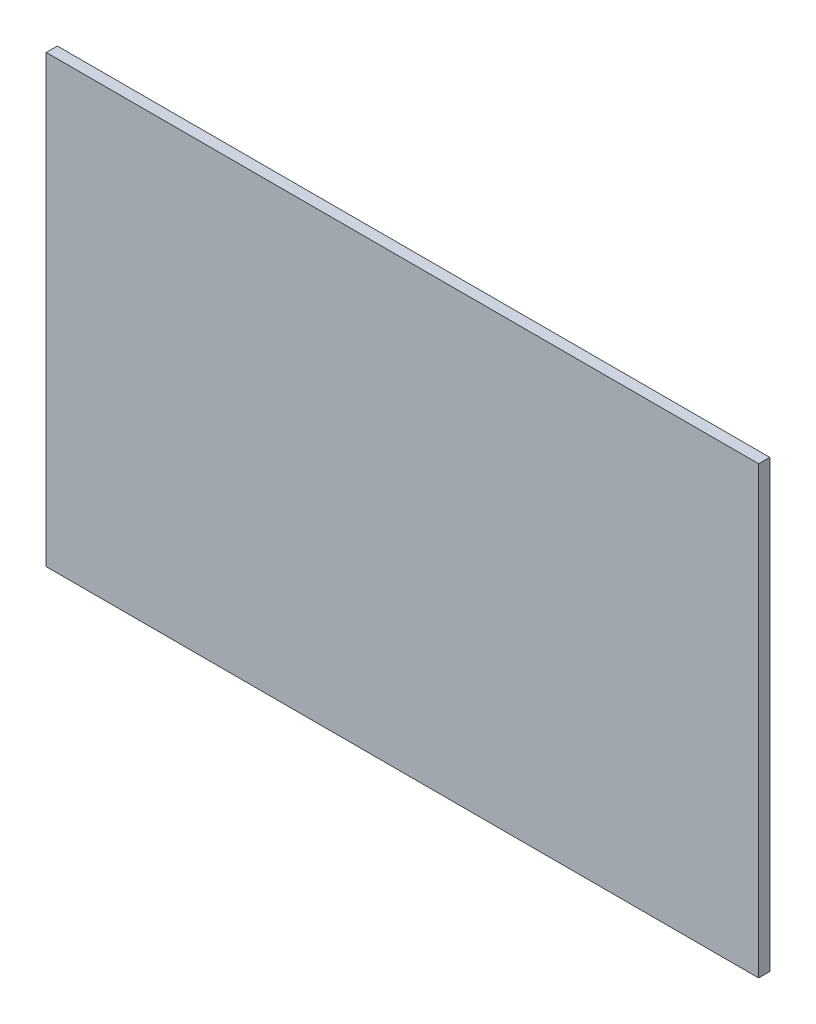
ISO-10303-21;
HEADER;
FILE_DESCRIPTION(('STEP AP214'),'2;1');
FILE_NAME('part.step','',(''),(''),'','','');
FILE_SCHEMA(('AUTOMOTIVE_DESIGN { 1 0 10303 214 1 1 1 1 }'));
ENDSEC;
DATA;
#1=APPLICATION_CONTEXT('core data for automotive mechanical design processes');
#2=APPLICATION_PROTOCOL_DEFINITION('international standard','automotive_design',2000,#1);
#3=PRODUCT_CONTEXT('',#1,'mechanical');
#4=PRODUCT('Part','Part','',(#3));
#5=PRODUCT_RELATED_PRODUCT_CATEGORY('part','',(#4));
#6=PRODUCT_DEFINITION_FORMATION('','',#4);
#7=PRODUCT_DEFINITION_CONTEXT('part definition',#1,'design');
#8=PRODUCT_DEFINITION('design','',#6,#7);
#9=PRODUCT_DEFINITION_SHAPE('','',#8);
#10=(LENGTH_UNIT() NAMED_UNIT(*) SI_UNIT(.MILLI.,.METRE.));
#11=(NAMED_UNIT(*) PLANE_ANGLE_UNIT() SI_UNIT($,.RADIAN.));
#12=(NAMED_UNIT(*) SI_UNIT($,.STERADIAN.) SOLID_ANGLE_UNIT());
#13=UNCERTAINTY_MEASURE_WITH_UNIT(LENGTH_MEASURE(1.E-05),#10,'distance_accuracy_value','');
#14=(GEOMETRIC_REPRESENTATION_CONTEXT(3) GLOBAL_UNCERTAINTY_ASSIGNED_CONTEXT((#13)) GLOBAL_UNIT_ASSIGNED_CONTEXT((#10,
#11,#12)) REPRESENTATION_CONTEXT('',''));
#15=CARTESIAN_POINT('',(0.,0.,0.));
#16=DIRECTION('',(0.,0.,1.));
#17=DIRECTION('',(1.,0.,0.));
#18=AXIS2_PLACEMENT_3D('',#15,#16,#17);
#19=CARTESIAN_POINT('',(-203.2,254.,6.35));
#20=DIRECTION('',(1.,0.,0.));
#21=DIRECTION('',(0.,1.,0.));
#22=AXIS2_PLACEMENT_3D('',#19,#20,#21);
#23=PLANE('',#22);
#24=DIRECTION('',(0.,-1.,0.));
#25=VECTOR('',#24,1.);
#26=CARTESIAN_POINT('',(-203.2,254.,0.));
#27=LINE('',#26,#25);
#28=CARTESIAN_POINT('',(-203.2,254.,0.));
#29=VERTEX_POINT('',#28);
#30=CARTESIAN_POINT('',(-203.2,0.,0.));
#31=VERTEX_POINT('',#30);
#32=EDGE_CURVE('E96',#29,#31,#27,.T.);
#33=ORIENTED_EDGE('',*,*,#32,.T.);
#34=DIRECTION('',(0.,0.,-1.));
#35=VECTOR('',#34,1.);
#36=CARTESIAN_POINT('',(-203.2,0.,6.35));
#37=LINE('',#36,#35);
#38=CARTESIAN_POINT('',(-203.2,0.,6.35));
#39=VERTEX_POINT('',#38);
#40=EDGE_CURVE('E11',#39,#31,#37,.T.);
#41=ORIENTED_EDGE('',*,*,#40,.F.);
#42=DIRECTION('',(0.,-1.,0.));
#43=VECTOR('',#42,1.);
#44=CARTESIAN_POINT('',(-203.2,254.,6.35));
#45=LINE('',#44,#43);
#46=CARTESIAN_POINT('',(-203.2,254.,6.35));
#47=VERTEX_POINT('',#46);
#48=EDGE_CURVE('E84',#47,#39,#45,.T.);
#49=ORIENTED_EDGE('',*,*,#48,.F.);
#50=DIRECTION('',(0.,0.,-1.));
#51=VECTOR('',#50,1.);
#52=CARTESIAN_POINT('',(-203.2,254.,6.35));
#53=LINE('',#52,#51);
#54=EDGE_CURVE('E92',#47,#29,#53,.T.);
#55=ORIENTED_EDGE('',*,*,#54,.T.);
#56=EDGE_LOOP('',(#33,#41,#49,#55));
#57=FACE_BOUND('',#56,.T.);
#58=ADVANCED_FACE('F33',(#57),#23,.F.);
#59=CARTESIAN_POINT('',(-203.2,0.,6.35));
#60=DIRECTION('',(0.,1.,0.));
#61=DIRECTION('',(0.,0.,1.));
#62=AXIS2_PLACEMENT_3D('',#59,#60,#61);
#63=PLANE('',#62);
#64=DIRECTION('',(1.,0.,0.));
#65=VECTOR('',#64,1.);
#66=CARTESIAN_POINT('',(-203.2,0.,0.));
#67=LINE('',#66,#65);
#68=CARTESIAN_POINT('',(203.2,0.,0.));
#69=VERTEX_POINT('',#68);
#70=EDGE_CURVE('E88',#31,#69,#67,.T.);
#71=ORIENTED_EDGE('',*,*,#70,.T.);
#72=DIRECTION('',(0.,0.,-1.));
#73=VECTOR('',#72,1.);
#74=CARTESIAN_POINT('',(203.2,0.,6.35));
#75=LINE('',#74,#73);
#76=CARTESIAN_POINT('',(203.2,0.,6.35));
#77=VERTEX_POINT('',#76);
#78=EDGE_CURVE('E41',#77,#69,#75,.T.);
#79=ORIENTED_EDGE('',*,*,#78,.F.);
#80=DIRECTION('',(1.,0.,0.));
#81=VECTOR('',#80,1.);
#82=CARTESIAN_POINT('',(-203.2,0.,6.35));
#83=LINE('',#82,#81);
#84=EDGE_CURVE('E79',#39,#77,#83,.T.);
#85=ORIENTED_EDGE('',*,*,#84,.F.);
#86=ORIENTED_EDGE('',*,*,#40,.T.);
#87=EDGE_LOOP('',(#71,#79,#85,#86));
#88=FACE_BOUND('',#87,.T.);
#89=ADVANCED_FACE('F87',(#88),#63,.F.);
#90=CARTESIAN_POINT('',(203.2,254.,6.35));
#91=DIRECTION('',(-1.,0.,0.));
#92=DIRECTION('',(0.,-1.,0.));
#93=AXIS2_PLACEMENT_3D('',#90,#91,#92);
#94=PLANE('',#93);
#95=DIRECTION('',(0.,1.,0.));
#96=VECTOR('',#95,1.);
#97=CARTESIAN_POINT('',(203.2,254.,0.));
#98=LINE('',#97,#96);
#99=CARTESIAN_POINT('',(203.2,254.,0.));
#100=VERTEX_POINT('',#99);
#101=EDGE_CURVE('E66',#69,#100,#98,.T.);
#102=ORIENTED_EDGE('',*,*,#101,.T.);
#103=DIRECTION('',(0.,0.,-1.));
#104=VECTOR('',#103,1.);
#105=CARTESIAN_POINT('',(203.2,254.,6.35));
#106=LINE('',#105,#104);
#107=CARTESIAN_POINT('',(203.2,254.,6.35));
#108=VERTEX_POINT('',#107);
#109=EDGE_CURVE('E89',#108,#100,#106,.T.);
#110=ORIENTED_EDGE('',*,*,#109,.F.);
#111=DIRECTION('',(0.,1.,0.));
#112=VECTOR('',#111,1.);
#113=CARTESIAN_POINT('',(203.2,254.,6.35));
#114=LINE('',#113,#112);
#115=EDGE_CURVE('E82',#77,#108,#114,.T.);
#116=ORIENTED_EDGE('',*,*,#115,.F.);
#117=ORIENTED_EDGE('',*,*,#78,.T.);
#118=EDGE_LOOP('',(#102,#110,#116,#117));
#119=FACE_BOUND('',#118,.T.);
#120=ADVANCED_FACE('F90',(#119),#94,.F.);
#121=CARTESIAN_POINT('',(-203.2,254.,6.35));
#122=DIRECTION('',(0.,-1.,0.));
#123=DIRECTION('',(1.,0.,0.));
#124=AXIS2_PLACEMENT_3D('',#121,#122,#123);
#125=PLANE('',#124);
#126=DIRECTION('',(-1.,0.,0.));
#127=VECTOR('',#126,1.);
#128=CARTESIAN_POINT('',(-203.2,254.,0.));
#129=LINE('',#128,#127);
#130=EDGE_CURVE('E72',#100,#29,#129,.T.);
#131=ORIENTED_EDGE('',*,*,#130,.T.);
#132=ORIENTED_EDGE('',*,*,#54,.F.);
#133=DIRECTION('',(-1.,0.,0.));
#134=VECTOR('',#133,1.);
#135=CARTESIAN_POINT('',(-203.2,254.,6.35));
#136=LINE('',#135,#134);
#137=EDGE_CURVE('E49',#108,#47,#136,.T.);
#138=ORIENTED_EDGE('',*,*,#137,.F.);
#139=ORIENTED_EDGE('',*,*,#109,.T.);
#140=EDGE_LOOP('',(#131,#132,#138,#139));
#141=FACE_BOUND('',#140,.T.);
#142=ADVANCED_FACE('F103',(#141),#125,.F.);
#143=CARTESIAN_POINT('',(0.,0.,6.35));
#144=DIRECTION('',(0.,0.,1.));
#145=DIRECTION('',(1.,0.,0.));
#146=AXIS2_PLACEMENT_3D('',#143,#144,#145);
#147=PLANE('',#146);
#148=ORIENTED_EDGE('',*,*,#48,.T.);
#149=ORIENTED_EDGE('',*,*,#84,.T.);
#150=ORIENTED_EDGE('',*,*,#115,.T.);
#151=ORIENTED_EDGE('',*,*,#137,.T.);
#152=EDGE_LOOP('',(#148,#149,#150,#151));
#153=FACE_BOUND('',#152,.T.);
#154=ADVANCED_FACE('F80',(#153),#147,.T.);
#155=CARTESIAN_POINT('',(0.,0.,0.));
#156=DIRECTION('',(0.,0.,1.));
#157=DIRECTION('',(1.,0.,0.));
#158=AXIS2_PLACEMENT_3D('',#155,#156,#157);
#159=PLANE('',#158);
#160=ORIENTED_EDGE('',*,*,#32,.F.);
#161=ORIENTED_EDGE('',*,*,#130,.F.);
#162=ORIENTED_EDGE('',*,*,#101,.F.);
#163=ORIENTED_EDGE('',*,*,#70,.F.);
#164=EDGE_LOOP('',(#160,#161,#162,#163));
#165=FACE_BOUND('',#164,.T.);
#166=ADVANCED_FACE('F106',(#165),#159,.F.);
#167=CLOSED_SHELL('',(#58,#89,#120,#142,#154,#166));
#168=MANIFOLD_SOLID_BREP('B2',#167);
#169=ADVANCED_BREP_SHAPE_REPRESENTATION('',(#18,#168),#14);
#170=SHAPE_DEFINITION_REPRESENTATION(#9,#169);
ENDSEC;
END-ISO-10303-21;
